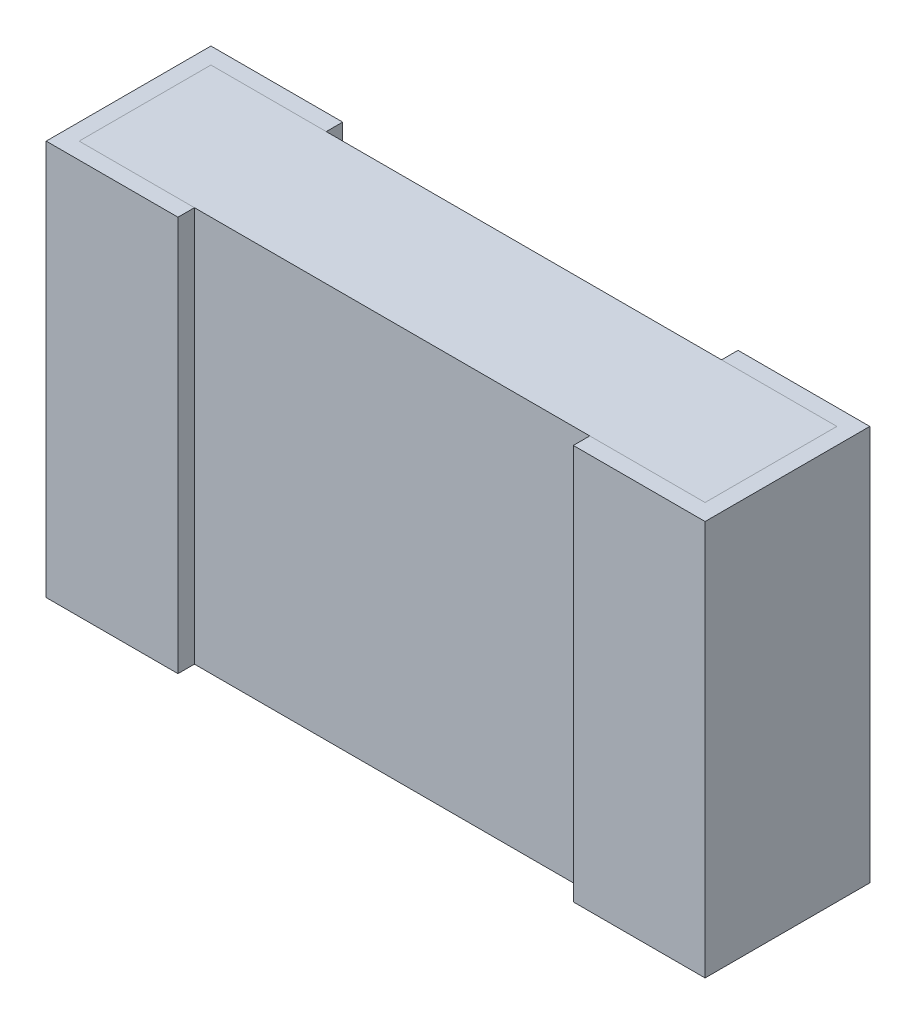
ISO-10303-21;
HEADER;
FILE_DESCRIPTION(('STEP AP214'),'2;1');
FILE_NAME('part.step','',(''),(''),'','','');
FILE_SCHEMA(('AUTOMOTIVE_DESIGN { 1 0 10303 214 1 1 1 1 }'));
ENDSEC;
DATA;
#1=APPLICATION_CONTEXT('core data for automotive mechanical design processes');
#2=APPLICATION_PROTOCOL_DEFINITION('international standard','automotive_design',2000,#1);
#3=PRODUCT_CONTEXT('',#1,'mechanical');
#4=PRODUCT('Part','Part','',(#3));
#5=PRODUCT_RELATED_PRODUCT_CATEGORY('part','',(#4));
#6=PRODUCT_DEFINITION_FORMATION('','',#4);
#7=PRODUCT_DEFINITION_CONTEXT('part definition',#1,'design');
#8=PRODUCT_DEFINITION('design','',#6,#7);
#9=PRODUCT_DEFINITION_SHAPE('','',#8);
#10=(LENGTH_UNIT() NAMED_UNIT(*) SI_UNIT(.MILLI.,.METRE.));
#11=(NAMED_UNIT(*) PLANE_ANGLE_UNIT() SI_UNIT($,.RADIAN.));
#12=(NAMED_UNIT(*) SI_UNIT($,.STERADIAN.) SOLID_ANGLE_UNIT());
#13=UNCERTAINTY_MEASURE_WITH_UNIT(LENGTH_MEASURE(1.E-05),#10,'distance_accuracy_value','');
#14=(GEOMETRIC_REPRESENTATION_CONTEXT(3) GLOBAL_UNCERTAINTY_ASSIGNED_CONTEXT((#13)) GLOBAL_UNIT_ASSIGNED_CONTEXT((#10,
#11,#12)) REPRESENTATION_CONTEXT('',''));
#15=CARTESIAN_POINT('',(0.,0.,0.));
#16=DIRECTION('',(0.,0.,1.));
#17=DIRECTION('',(1.,0.,0.));
#18=AXIS2_PLACEMENT_3D('',#15,#16,#17);
#19=CARTESIAN_POINT('',(0.561829086584,1.2,0.09556197731724));
#20=DIRECTION('',(0.,0.,1.));
#21=DIRECTION('',(1.,0.,0.));
#22=AXIS2_PLACEMENT_3D('',#19,#20,#21);
#23=PLANE('',#22);
#24=DIRECTION('',(1.,0.,0.));
#25=VECTOR('',#24,1.);
#26=CARTESIAN_POINT('',(0.,1.2,0.09556197731724));
#27=LINE('',#26,#25);
#28=CARTESIAN_POINT('',(0.561829086584,1.2,0.09556197731724));
#29=VERTEX_POINT('',#28);
#30=CARTESIAN_POINT('',(0.211829086584,1.2,0.09556197731724));
#31=VERTEX_POINT('',#30);
#32=EDGE_CURVE('P0_E115',#29,#31,#27,.F.);
#33=ORIENTED_EDGE('',*,*,#32,.F.);
#34=DIRECTION('',(0.,1.,0.));
#35=VECTOR('',#34,1.);
#36=CARTESIAN_POINT('',(0.561829086584,1.2,0.09556197731724));
#37=LINE('',#36,#35);
#38=CARTESIAN_POINT('',(0.561829086584,0.,0.09556197731724));
#39=VERTEX_POINT('',#38);
#40=EDGE_CURVE('P0_E92',#29,#39,#37,.F.);
#41=ORIENTED_EDGE('',*,*,#40,.T.);
#42=DIRECTION('',(1.,0.,0.));
#43=VECTOR('',#42,1.);
#44=CARTESIAN_POINT('',(0.,0.,0.09556197731724));
#45=LINE('',#44,#43);
#46=CARTESIAN_POINT('',(0.211829086584,0.,0.09556197731724));
#47=VERTEX_POINT('',#46);
#48=EDGE_CURVE('P0_E116',#39,#47,#45,.F.);
#49=ORIENTED_EDGE('',*,*,#48,.T.);
#50=DIRECTION('',(0.,1.,0.));
#51=VECTOR('',#50,1.);
#52=CARTESIAN_POINT('',(0.211829086584,1.2,0.09556197731724));
#53=LINE('',#52,#51);
#54=EDGE_CURVE('P0_E19',#47,#31,#53,.T.);
#55=ORIENTED_EDGE('',*,*,#54,.T.);
#56=EDGE_LOOP('',(#33,#41,#49,#55));
#57=FACE_BOUND('',#56,.T.);
#58=ADVANCED_FACE('P0_F16',(#57),#23,.F.);
#59=CARTESIAN_POINT('',(0.211829086584,1.2,0.09556197731724));
#60=DIRECTION('',(-1.,0.,0.));
#61=DIRECTION('',(0.,0.,1.));
#62=AXIS2_PLACEMENT_3D('',#59,#60,#61);
#63=PLANE('',#62);
#64=DIRECTION('',(0.,0.,1.));
#65=VECTOR('',#64,1.);
#66=CARTESIAN_POINT('',(0.211829086584,1.2,0.));
#67=LINE('',#66,#65);
#68=CARTESIAN_POINT('',(0.211829086584,1.2,-0.304438022683));
#69=VERTEX_POINT('',#68);
#70=EDGE_CURVE('P0_E117',#31,#69,#67,.F.);
#71=ORIENTED_EDGE('',*,*,#70,.F.);
#72=ORIENTED_EDGE('',*,*,#54,.F.);
#73=DIRECTION('',(0.,0.,1.));
#74=VECTOR('',#73,1.);
#75=CARTESIAN_POINT('',(0.211829086584,0.,0.));
#76=LINE('',#75,#74);
#77=CARTESIAN_POINT('',(0.211829086584,0.,-0.304438022683));
#78=VERTEX_POINT('',#77);
#79=EDGE_CURVE('P0_E129',#47,#78,#76,.F.);
#80=ORIENTED_EDGE('',*,*,#79,.T.);
#81=DIRECTION('',(0.,1.,0.));
#82=VECTOR('',#81,1.);
#83=CARTESIAN_POINT('',(0.211829086584,1.2,-0.304438022683));
#84=LINE('',#83,#82);
#85=EDGE_CURVE('P0_E79',#78,#69,#84,.T.);
#86=ORIENTED_EDGE('',*,*,#85,.T.);
#87=EDGE_LOOP('',(#71,#72,#80,#86));
#88=FACE_BOUND('',#87,.T.);
#89=ADVANCED_FACE('P0_F118',(#88),#63,.F.);
#90=CARTESIAN_POINT('',(0.211829086584,1.2,-0.304438022683));
#91=DIRECTION('',(0.,0.,-1.));
#92=DIRECTION('',(-1.,0.,0.));
#93=AXIS2_PLACEMENT_3D('',#90,#91,#92);
#94=PLANE('',#93);
#95=DIRECTION('',(1.,0.,0.));
#96=VECTOR('',#95,1.);
#97=CARTESIAN_POINT('',(0.,1.2,-0.304438022683));
#98=LINE('',#97,#96);
#99=CARTESIAN_POINT('',(0.561829086584,1.2,-0.304438022683));
#100=VERTEX_POINT('',#99);
#101=EDGE_CURVE('P0_E120',#69,#100,#98,.T.);
#102=ORIENTED_EDGE('',*,*,#101,.F.);
#103=ORIENTED_EDGE('',*,*,#85,.F.);
#104=DIRECTION('',(1.,0.,0.));
#105=VECTOR('',#104,1.);
#106=CARTESIAN_POINT('',(0.,0.,-0.304438022683));
#107=LINE('',#106,#105);
#108=CARTESIAN_POINT('',(0.561829086584,0.,-0.304438022683));
#109=VERTEX_POINT('',#108);
#110=EDGE_CURVE('P0_E99',#78,#109,#107,.T.);
#111=ORIENTED_EDGE('',*,*,#110,.T.);
#112=DIRECTION('',(0.,1.,0.));
#113=VECTOR('',#112,1.);
#114=CARTESIAN_POINT('',(0.561829086584,1.2,-0.304438022683));
#115=LINE('',#114,#113);
#116=EDGE_CURVE('P0_E85',#109,#100,#115,.T.);
#117=ORIENTED_EDGE('',*,*,#116,.T.);
#118=EDGE_LOOP('',(#102,#103,#111,#117));
#119=FACE_BOUND('',#118,.T.);
#120=ADVANCED_FACE('P0_F105',(#119),#94,.F.);
#121=CARTESIAN_POINT('',(0.561829086584,1.2,-0.304438022683));
#122=DIRECTION('',(-1.,0.,0.));
#123=DIRECTION('',(0.,0.,1.));
#124=AXIS2_PLACEMENT_3D('',#121,#122,#123);
#125=PLANE('',#124);
#126=DIRECTION('',(0.,0.,1.));
#127=VECTOR('',#126,1.);
#128=CARTESIAN_POINT('',(0.561829086584,1.2,0.));
#129=LINE('',#128,#127);
#130=CARTESIAN_POINT('',(0.561829086584,1.2,-0.354438022683));
#131=VERTEX_POINT('',#130);
#132=EDGE_CURVE('P0_E91',#100,#131,#129,.F.);
#133=ORIENTED_EDGE('',*,*,#132,.F.);
#134=ORIENTED_EDGE('',*,*,#116,.F.);
#135=DIRECTION('',(0.,0.,1.));
#136=VECTOR('',#135,1.);
#137=CARTESIAN_POINT('',(0.561829086584,0.,0.));
#138=LINE('',#137,#136);
#139=CARTESIAN_POINT('',(0.561829086584,0.,-0.354438022683));
#140=VERTEX_POINT('',#139);
#141=EDGE_CURVE('P0_E89',#109,#140,#138,.F.);
#142=ORIENTED_EDGE('',*,*,#141,.T.);
#143=DIRECTION('',(0.,1.,0.));
#144=VECTOR('',#143,1.);
#145=CARTESIAN_POINT('',(0.561829086584,1.2,-0.354438022683));
#146=LINE('',#145,#144);
#147=EDGE_CURVE('P0_E123',#140,#131,#146,.T.);
#148=ORIENTED_EDGE('',*,*,#147,.T.);
#149=EDGE_LOOP('',(#133,#134,#142,#148));
#150=FACE_BOUND('',#149,.T.);
#151=ADVANCED_FACE('P0_F87',(#150),#125,.F.);
#152=CARTESIAN_POINT('',(0.561829086584,1.2,0.145561977317));
#153=DIRECTION('',(-1.,0.,0.));
#154=DIRECTION('',(0.,0.,1.));
#155=AXIS2_PLACEMENT_3D('',#152,#153,#154);
#156=PLANE('',#155);
#157=DIRECTION('',(0.,0.,1.));
#158=VECTOR('',#157,1.);
#159=CARTESIAN_POINT('',(0.561829086584,1.2,0.));
#160=LINE('',#159,#158);
#161=CARTESIAN_POINT('',(0.561829086584,1.2,0.145561977317));
#162=VERTEX_POINT('',#161);
#163=EDGE_CURVE('P0_E141',#162,#29,#160,.F.);
#164=ORIENTED_EDGE('',*,*,#163,.F.);
#165=DIRECTION('',(0.,1.,0.));
#166=VECTOR('',#165,1.);
#167=CARTESIAN_POINT('',(0.561829086584,1.2,0.145561977317));
#168=LINE('',#167,#166);
#169=CARTESIAN_POINT('',(0.561829086584,0.,0.145561977317));
#170=VERTEX_POINT('',#169);
#171=EDGE_CURVE('P0_E136',#162,#170,#168,.F.);
#172=ORIENTED_EDGE('',*,*,#171,.T.);
#173=DIRECTION('',(0.,0.,1.));
#174=VECTOR('',#173,1.);
#175=CARTESIAN_POINT('',(0.561829086584,0.,0.));
#176=LINE('',#175,#174);
#177=EDGE_CURVE('P0_E103',#170,#39,#176,.F.);
#178=ORIENTED_EDGE('',*,*,#177,.T.);
#179=ORIENTED_EDGE('',*,*,#40,.F.);
#180=EDGE_LOOP('',(#164,#172,#178,#179));
#181=FACE_BOUND('',#180,.T.);
#182=ADVANCED_FACE('P0_F134',(#181),#156,.F.);
#183=CARTESIAN_POINT('',(0.,0.,0.));
#184=DIRECTION('',(0.,1.,0.));
#185=DIRECTION('',(0.,0.,1.));
#186=AXIS2_PLACEMENT_3D('',#183,#184,#185);
#187=PLANE('',#186);
#188=ORIENTED_EDGE('',*,*,#48,.F.);
#189=ORIENTED_EDGE('',*,*,#177,.F.);
#190=DIRECTION('',(-1.,0.,0.));
#191=VECTOR('',#190,1.);
#192=CARTESIAN_POINT('',(0.161829086584,0.,0.145561977317));
#193=LINE('',#192,#191);
#194=CARTESIAN_POINT('',(0.161829086584,0.,0.145561977317));
#195=VERTEX_POINT('',#194);
#196=EDGE_CURVE('P0_E139',#170,#195,#193,.T.);
#197=ORIENTED_EDGE('',*,*,#196,.T.);
#198=DIRECTION('',(0.,0.,-1.));
#199=VECTOR('',#198,1.);
#200=CARTESIAN_POINT('',(0.161829086584,0.,-0.354438022683));
#201=LINE('',#200,#199);
#202=CARTESIAN_POINT('',(0.161829086584,0.,-0.354438022683));
#203=VERTEX_POINT('',#202);
#204=EDGE_CURVE('P0_E158',#195,#203,#201,.T.);
#205=ORIENTED_EDGE('',*,*,#204,.T.);
#206=DIRECTION('',(1.,0.,0.));
#207=VECTOR('',#206,1.);
#208=CARTESIAN_POINT('',(0.561829086584,0.,-0.354438022683));
#209=LINE('',#208,#207);
#210=EDGE_CURVE('P0_E102',#203,#140,#209,.T.);
#211=ORIENTED_EDGE('',*,*,#210,.T.);
#212=ORIENTED_EDGE('',*,*,#141,.F.);
#213=ORIENTED_EDGE('',*,*,#110,.F.);
#214=ORIENTED_EDGE('',*,*,#79,.F.);
#215=EDGE_LOOP('',(#188,#189,#197,#205,#211,#212,#213,#214));
#216=FACE_BOUND('',#215,.T.);
#217=ADVANCED_FACE('P0_F97',(#216),#187,.F.);
#218=CARTESIAN_POINT('',(0.561829086584,1.2,-0.354438022683));
#219=DIRECTION('',(0.,0.,1.));
#220=DIRECTION('',(1.,0.,0.));
#221=AXIS2_PLACEMENT_3D('',#218,#219,#220);
#222=PLANE('',#221);
#223=DIRECTION('',(1.,0.,0.));
#224=VECTOR('',#223,1.);
#225=CARTESIAN_POINT('',(0.,1.2,-0.354438022683));
#226=LINE('',#225,#224);
#227=CARTESIAN_POINT('',(0.161829086584,1.2,-0.354438022683));
#228=VERTEX_POINT('',#227);
#229=EDGE_CURVE('P0_E144',#131,#228,#226,.F.);
#230=ORIENTED_EDGE('',*,*,#229,.F.);
#231=ORIENTED_EDGE('',*,*,#147,.F.);
#232=ORIENTED_EDGE('',*,*,#210,.F.);
#233=DIRECTION('',(0.,1.,0.));
#234=VECTOR('',#233,1.);
#235=CARTESIAN_POINT('',(0.161829086584,1.2,-0.354438022683));
#236=LINE('',#235,#234);
#237=EDGE_CURVE('P0_E156',#203,#228,#236,.T.);
#238=ORIENTED_EDGE('',*,*,#237,.T.);
#239=EDGE_LOOP('',(#230,#231,#232,#238));
#240=FACE_BOUND('',#239,.T.);
#241=ADVANCED_FACE('P0_F154',(#240),#222,.F.);
#242=CARTESIAN_POINT('',(0.,1.2,0.));
#243=DIRECTION('',(0.,1.,0.));
#244=DIRECTION('',(0.,0.,1.));
#245=AXIS2_PLACEMENT_3D('',#242,#243,#244);
#246=PLANE('',#245);
#247=DIRECTION('',(-1.,0.,0.));
#248=VECTOR('',#247,1.);
#249=CARTESIAN_POINT('',(0.161829086584,1.2,0.145561977317));
#250=LINE('',#249,#248);
#251=CARTESIAN_POINT('',(0.161829086584,1.2,0.145561977317));
#252=VERTEX_POINT('',#251);
#253=EDGE_CURVE('P0_E33',#252,#162,#250,.F.);
#254=ORIENTED_EDGE('',*,*,#253,.T.);
#255=ORIENTED_EDGE('',*,*,#163,.T.);
#256=ORIENTED_EDGE('',*,*,#32,.T.);
#257=ORIENTED_EDGE('',*,*,#70,.T.);
#258=ORIENTED_EDGE('',*,*,#101,.T.);
#259=ORIENTED_EDGE('',*,*,#132,.T.);
#260=ORIENTED_EDGE('',*,*,#229,.T.);
#261=DIRECTION('',(0.,0.,-1.));
#262=VECTOR('',#261,1.);
#263=CARTESIAN_POINT('',(0.161829086584,1.2,-0.354438022683));
#264=LINE('',#263,#262);
#265=EDGE_CURVE('P0_E25',#228,#252,#264,.F.);
#266=ORIENTED_EDGE('',*,*,#265,.T.);
#267=EDGE_LOOP('',(#254,#255,#256,#257,#258,#259,#260,#266));
#268=FACE_BOUND('',#267,.T.);
#269=ADVANCED_FACE('P0_F148',(#268),#246,.T.);
#270=CARTESIAN_POINT('',(0.161829086584,1.2,0.145561977317));
#271=DIRECTION('',(0.,0.,-1.));
#272=DIRECTION('',(-1.,0.,0.));
#273=AXIS2_PLACEMENT_3D('',#270,#271,#272);
#274=PLANE('',#273);
#275=ORIENTED_EDGE('',*,*,#253,.F.);
#276=DIRECTION('',(0.,1.,0.));
#277=VECTOR('',#276,1.);
#278=CARTESIAN_POINT('',(0.161829086584,1.2,0.145561977317));
#279=LINE('',#278,#277);
#280=EDGE_CURVE('P0_E11',#252,#195,#279,.F.);
#281=ORIENTED_EDGE('',*,*,#280,.T.);
#282=ORIENTED_EDGE('',*,*,#196,.F.);
#283=ORIENTED_EDGE('',*,*,#171,.F.);
#284=EDGE_LOOP('',(#275,#281,#282,#283));
#285=FACE_BOUND('',#284,.T.);
#286=ADVANCED_FACE('P0_F140',(#285),#274,.F.);
#287=CARTESIAN_POINT('',(0.161829086584,1.2,-0.354438022683));
#288=DIRECTION('',(1.,0.,0.));
#289=DIRECTION('',(0.,0.,-1.));
#290=AXIS2_PLACEMENT_3D('',#287,#288,#289);
#291=PLANE('',#290);
#292=ORIENTED_EDGE('',*,*,#265,.F.);
#293=ORIENTED_EDGE('',*,*,#237,.F.);
#294=ORIENTED_EDGE('',*,*,#204,.F.);
#295=ORIENTED_EDGE('',*,*,#280,.F.);
#296=EDGE_LOOP('',(#292,#293,#294,#295));
#297=FACE_BOUND('',#296,.T.);
#298=ADVANCED_FACE('P0_F162',(#297),#291,.F.);
#299=CLOSED_SHELL('',(#58,#89,#120,#151,#182,#217,#241,#269,#286,#298));
#300=MANIFOLD_SOLID_BREP('P0_B1',#299);
#301=CARTESIAN_POINT('',(2.111829086584,1.2,-0.304438022683));
#302=DIRECTION('',(0.,0.,-1.));
#303=DIRECTION('',(-1.,0.,0.));
#304=AXIS2_PLACEMENT_3D('',#301,#302,#303);
#305=PLANE('',#304);
#306=DIRECTION('',(1.,0.,0.));
#307=VECTOR('',#306,1.);
#308=CARTESIAN_POINT('',(0.,1.2,-0.304438022683));
#309=LINE('',#308,#307);
#310=CARTESIAN_POINT('',(1.761829086584,1.2,-0.304438022683));
#311=VERTEX_POINT('',#310);
#312=CARTESIAN_POINT('',(2.111829086584,1.2,-0.304438022683));
#313=VERTEX_POINT('',#312);
#314=EDGE_CURVE('P1_E125',#311,#313,#309,.T.);
#315=ORIENTED_EDGE('',*,*,#314,.F.);
#316=DIRECTION('',(0.,1.,0.));
#317=VECTOR('',#316,1.);
#318=CARTESIAN_POINT('',(1.761829086584,1.2,-0.304438022683));
#319=LINE('',#318,#317);
#320=CARTESIAN_POINT('',(1.761829086584,0.,-0.304438022683));
#321=VERTEX_POINT('',#320);
#322=EDGE_CURVE('P1_E102',#311,#321,#319,.F.);
#323=ORIENTED_EDGE('',*,*,#322,.T.);
#324=DIRECTION('',(1.,0.,0.));
#325=VECTOR('',#324,1.);
#326=CARTESIAN_POINT('',(0.,0.,-0.304438022683));
#327=LINE('',#326,#325);
#328=CARTESIAN_POINT('',(2.111829086584,0.,-0.304438022683));
#329=VERTEX_POINT('',#328);
#330=EDGE_CURVE('P1_E133',#321,#329,#327,.T.);
#331=ORIENTED_EDGE('',*,*,#330,.T.);
#332=DIRECTION('',(0.,1.,0.));
#333=VECTOR('',#332,1.);
#334=CARTESIAN_POINT('',(2.111829086584,1.2,-0.304438022683));
#335=LINE('',#334,#333);
#336=EDGE_CURVE('P1_E19',#329,#313,#335,.T.);
#337=ORIENTED_EDGE('',*,*,#336,.T.);
#338=EDGE_LOOP('',(#315,#323,#331,#337));
#339=FACE_BOUND('',#338,.T.);
#340=ADVANCED_FACE('P1_F16',(#339),#305,.F.);
#341=CARTESIAN_POINT('',(2.111829086584,1.2,0.09556197731724));
#342=DIRECTION('',(1.,0.,0.));
#343=DIRECTION('',(0.,0.,-1.));
#344=AXIS2_PLACEMENT_3D('',#341,#342,#343);
#345=PLANE('',#344);
#346=DIRECTION('',(0.,0.,1.));
#347=VECTOR('',#346,1.);
#348=CARTESIAN_POINT('',(2.111829086584,1.2,0.));
#349=LINE('',#348,#347);
#350=CARTESIAN_POINT('',(2.111829086584,1.2,0.09556197731724));
#351=VERTEX_POINT('',#350);
#352=EDGE_CURVE('P1_E120',#313,#351,#349,.T.);
#353=ORIENTED_EDGE('',*,*,#352,.F.);
#354=ORIENTED_EDGE('',*,*,#336,.F.);
#355=DIRECTION('',(0.,0.,1.));
#356=VECTOR('',#355,1.);
#357=CARTESIAN_POINT('',(2.111829086584,0.,0.));
#358=LINE('',#357,#356);
#359=CARTESIAN_POINT('',(2.111829086584,0.,0.09556197731724));
#360=VERTEX_POINT('',#359);
#361=EDGE_CURVE('P1_E96',#329,#360,#358,.T.);
#362=ORIENTED_EDGE('',*,*,#361,.T.);
#363=DIRECTION('',(0.,1.,0.));
#364=VECTOR('',#363,1.);
#365=CARTESIAN_POINT('',(2.111829086584,1.2,0.09556197731724));
#366=LINE('',#365,#364);
#367=EDGE_CURVE('P1_E85',#360,#351,#366,.T.);
#368=ORIENTED_EDGE('',*,*,#367,.T.);
#369=EDGE_LOOP('',(#353,#354,#362,#368));
#370=FACE_BOUND('',#369,.T.);
#371=ADVANCED_FACE('P1_F101',(#370),#345,.F.);
#372=CARTESIAN_POINT('',(1.761829086584,1.2,0.09556197731724));
#373=DIRECTION('',(0.,0.,1.));
#374=DIRECTION('',(1.,0.,0.));
#375=AXIS2_PLACEMENT_3D('',#372,#373,#374);
#376=PLANE('',#375);
#377=DIRECTION('',(1.,0.,0.));
#378=VECTOR('',#377,1.);
#379=CARTESIAN_POINT('',(0.,1.2,0.09556197731724));
#380=LINE('',#379,#378);
#381=CARTESIAN_POINT('',(1.761829086584,1.2,0.09556197731724));
#382=VERTEX_POINT('',#381);
#383=EDGE_CURVE('P1_E90',#351,#382,#380,.F.);
#384=ORIENTED_EDGE('',*,*,#383,.F.);
#385=ORIENTED_EDGE('',*,*,#367,.F.);
#386=DIRECTION('',(1.,0.,0.));
#387=VECTOR('',#386,1.);
#388=CARTESIAN_POINT('',(0.,0.,0.09556197731724));
#389=LINE('',#388,#387);
#390=CARTESIAN_POINT('',(1.761829086584,0.,0.09556197731724));
#391=VERTEX_POINT('',#390);
#392=EDGE_CURVE('P1_E89',#360,#391,#389,.F.);
#393=ORIENTED_EDGE('',*,*,#392,.T.);
#394=DIRECTION('',(0.,1.,0.));
#395=VECTOR('',#394,1.);
#396=CARTESIAN_POINT('',(1.761829086584,1.2,0.09556197731724));
#397=LINE('',#396,#395);
#398=EDGE_CURVE('P1_E91',#391,#382,#397,.T.);
#399=ORIENTED_EDGE('',*,*,#398,.T.);
#400=EDGE_LOOP('',(#384,#385,#393,#399));
#401=FACE_BOUND('',#400,.T.);
#402=ADVANCED_FACE('P1_F87',(#401),#376,.F.);
#403=CARTESIAN_POINT('',(1.761829086584,1.2,0.145561977317));
#404=DIRECTION('',(1.,0.,0.));
#405=DIRECTION('',(0.,0.,-1.));
#406=AXIS2_PLACEMENT_3D('',#403,#404,#405);
#407=PLANE('',#406);
#408=DIRECTION('',(0.,0.,1.));
#409=VECTOR('',#408,1.);
#410=CARTESIAN_POINT('',(1.761829086584,1.2,0.));
#411=LINE('',#410,#409);
#412=CARTESIAN_POINT('',(1.761829086584,1.2,0.145561977317));
#413=VERTEX_POINT('',#412);
#414=EDGE_CURVE('P1_E110',#382,#413,#411,.T.);
#415=ORIENTED_EDGE('',*,*,#414,.F.);
#416=ORIENTED_EDGE('',*,*,#398,.F.);
#417=DIRECTION('',(0.,0.,1.));
#418=VECTOR('',#417,1.);
#419=CARTESIAN_POINT('',(1.761829086584,0.,0.));
#420=LINE('',#419,#418);
#421=CARTESIAN_POINT('',(1.761829086584,0.,0.145561977317));
#422=VERTEX_POINT('',#421);
#423=EDGE_CURVE('P1_E99',#391,#422,#420,.T.);
#424=ORIENTED_EDGE('',*,*,#423,.T.);
#425=DIRECTION('',(0.,1.,0.));
#426=VECTOR('',#425,1.);
#427=CARTESIAN_POINT('',(1.761829086584,1.2,0.145561977317));
#428=LINE('',#427,#426);
#429=EDGE_CURVE('P1_E113',#422,#413,#428,.T.);
#430=ORIENTED_EDGE('',*,*,#429,.T.);
#431=EDGE_LOOP('',(#415,#416,#424,#430));
#432=FACE_BOUND('',#431,.T.);
#433=ADVANCED_FACE('P1_F111',(#432),#407,.F.);
#434=CARTESIAN_POINT('',(1.761829086584,1.2,-0.304438022683));
#435=DIRECTION('',(1.,0.,0.));
#436=DIRECTION('',(0.,0.,-1.));
#437=AXIS2_PLACEMENT_3D('',#434,#435,#436);
#438=PLANE('',#437);
#439=DIRECTION('',(0.,0.,1.));
#440=VECTOR('',#439,1.);
#441=CARTESIAN_POINT('',(1.761829086584,1.2,0.));
#442=LINE('',#441,#440);
#443=CARTESIAN_POINT('',(1.761829086584,1.2,-0.354438022683));
#444=VERTEX_POINT('',#443);
#445=EDGE_CURVE('P1_E127',#444,#311,#442,.T.);
#446=ORIENTED_EDGE('',*,*,#445,.F.);
#447=DIRECTION('',(0.,1.,0.));
#448=VECTOR('',#447,1.);
#449=CARTESIAN_POINT('',(1.761829086584,1.2,-0.354438022683));
#450=LINE('',#449,#448);
#451=CARTESIAN_POINT('',(1.761829086584,0.,-0.354438022683));
#452=VERTEX_POINT('',#451);
#453=EDGE_CURVE('P1_E147',#444,#452,#450,.F.);
#454=ORIENTED_EDGE('',*,*,#453,.T.);
#455=DIRECTION('',(0.,0.,1.));
#456=VECTOR('',#455,1.);
#457=CARTESIAN_POINT('',(1.761829086584,0.,0.));
#458=LINE('',#457,#456);
#459=EDGE_CURVE('P1_E135',#452,#321,#458,.T.);
#460=ORIENTED_EDGE('',*,*,#459,.T.);
#461=ORIENTED_EDGE('',*,*,#322,.F.);
#462=EDGE_LOOP('',(#446,#454,#460,#461));
#463=FACE_BOUND('',#462,.T.);
#464=ADVANCED_FACE('P1_F161',(#463),#438,.F.);
#465=CARTESIAN_POINT('',(0.,0.,0.));
#466=DIRECTION('',(0.,1.,0.));
#467=DIRECTION('',(0.,0.,1.));
#468=AXIS2_PLACEMENT_3D('',#465,#466,#467);
#469=PLANE('',#468);
#470=ORIENTED_EDGE('',*,*,#459,.F.);
#471=DIRECTION('',(1.,0.,0.));
#472=VECTOR('',#471,1.);
#473=CARTESIAN_POINT('',(1.761829086584,0.,-0.354438022683));
#474=LINE('',#473,#472);
#475=CARTESIAN_POINT('',(2.161829086584,0.,-0.354438022683));
#476=VERTEX_POINT('',#475);
#477=EDGE_CURVE('P1_E118',#452,#476,#474,.T.);
#478=ORIENTED_EDGE('',*,*,#477,.T.);
#479=DIRECTION('',(0.,0.,1.));
#480=VECTOR('',#479,1.);
#481=CARTESIAN_POINT('',(2.161829086584,0.,-0.354438022683));
#482=LINE('',#481,#480);
#483=CARTESIAN_POINT('',(2.161829086584,0.,0.145561977317));
#484=VERTEX_POINT('',#483);
#485=EDGE_CURVE('P1_E143',#476,#484,#482,.T.);
#486=ORIENTED_EDGE('',*,*,#485,.T.);
#487=DIRECTION('',(-1.,0.,0.));
#488=VECTOR('',#487,1.);
#489=CARTESIAN_POINT('',(2.161829086584,0.,0.145561977317));
#490=LINE('',#489,#488);
#491=EDGE_CURVE('P1_E131',#484,#422,#490,.T.);
#492=ORIENTED_EDGE('',*,*,#491,.T.);
#493=ORIENTED_EDGE('',*,*,#423,.F.);
#494=ORIENTED_EDGE('',*,*,#392,.F.);
#495=ORIENTED_EDGE('',*,*,#361,.F.);
#496=ORIENTED_EDGE('',*,*,#330,.F.);
#497=EDGE_LOOP('',(#470,#478,#486,#492,#493,#494,#495,#496));
#498=FACE_BOUND('',#497,.T.);
#499=ADVANCED_FACE('P1_F94',(#498),#469,.F.);
#500=CARTESIAN_POINT('',(2.161829086584,1.2,0.145561977317));
#501=DIRECTION('',(0.,0.,-1.));
#502=DIRECTION('',(-1.,0.,0.));
#503=AXIS2_PLACEMENT_3D('',#500,#501,#502);
#504=PLANE('',#503);
#505=DIRECTION('',(1.,0.,0.));
#506=VECTOR('',#505,1.);
#507=CARTESIAN_POINT('',(0.,1.2,0.145561977317));
#508=LINE('',#507,#506);
#509=CARTESIAN_POINT('',(2.161829086584,1.2,0.145561977317));
#510=VERTEX_POINT('',#509);
#511=EDGE_CURVE('P1_E116',#413,#510,#508,.T.);
#512=ORIENTED_EDGE('',*,*,#511,.F.);
#513=ORIENTED_EDGE('',*,*,#429,.F.);
#514=ORIENTED_EDGE('',*,*,#491,.F.);
#515=DIRECTION('',(0.,1.,0.));
#516=VECTOR('',#515,1.);
#517=CARTESIAN_POINT('',(2.161829086584,1.2,0.145561977317));
#518=LINE('',#517,#516);
#519=EDGE_CURVE('P1_E146',#484,#510,#518,.T.);
#520=ORIENTED_EDGE('',*,*,#519,.T.);
#521=EDGE_LOOP('',(#512,#513,#514,#520));
#522=FACE_BOUND('',#521,.T.);
#523=ADVANCED_FACE('P1_F138',(#522),#504,.F.);
#524=CARTESIAN_POINT('',(0.,1.2,0.));
#525=DIRECTION('',(0.,1.,0.));
#526=DIRECTION('',(0.,0.,1.));
#527=AXIS2_PLACEMENT_3D('',#524,#525,#526);
#528=PLANE('',#527);
#529=DIRECTION('',(0.,0.,1.));
#530=VECTOR('',#529,1.);
#531=CARTESIAN_POINT('',(2.161829086584,1.2,-0.354438022683));
#532=LINE('',#531,#530);
#533=CARTESIAN_POINT('',(2.161829086584,1.2,-0.354438022683));
#534=VERTEX_POINT('',#533);
#535=EDGE_CURVE('P1_E25',#510,#534,#532,.F.);
#536=ORIENTED_EDGE('',*,*,#535,.T.);
#537=DIRECTION('',(1.,0.,0.));
#538=VECTOR('',#537,1.);
#539=CARTESIAN_POINT('',(1.761829086584,1.2,-0.354438022683));
#540=LINE('',#539,#538);
#541=EDGE_CURVE('P1_E33',#534,#444,#540,.F.);
#542=ORIENTED_EDGE('',*,*,#541,.T.);
#543=ORIENTED_EDGE('',*,*,#445,.T.);
#544=ORIENTED_EDGE('',*,*,#314,.T.);
#545=ORIENTED_EDGE('',*,*,#352,.T.);
#546=ORIENTED_EDGE('',*,*,#383,.T.);
#547=ORIENTED_EDGE('',*,*,#414,.T.);
#548=ORIENTED_EDGE('',*,*,#511,.T.);
#549=EDGE_LOOP('',(#536,#542,#543,#544,#545,#546,#547,#548));
#550=FACE_BOUND('',#549,.T.);
#551=ADVANCED_FACE('P1_F155',(#550),#528,.T.);
#552=CARTESIAN_POINT('',(1.761829086584,1.2,-0.354438022683));
#553=DIRECTION('',(0.,0.,1.));
#554=DIRECTION('',(1.,0.,0.));
#555=AXIS2_PLACEMENT_3D('',#552,#553,#554);
#556=PLANE('',#555);
#557=ORIENTED_EDGE('',*,*,#541,.F.);
#558=DIRECTION('',(0.,1.,0.));
#559=VECTOR('',#558,1.);
#560=CARTESIAN_POINT('',(2.161829086584,1.2,-0.354438022683));
#561=LINE('',#560,#559);
#562=EDGE_CURVE('P1_E11',#534,#476,#561,.F.);
#563=ORIENTED_EDGE('',*,*,#562,.T.);
#564=ORIENTED_EDGE('',*,*,#477,.F.);
#565=ORIENTED_EDGE('',*,*,#453,.F.);
#566=EDGE_LOOP('',(#557,#563,#564,#565));
#567=FACE_BOUND('',#566,.T.);
#568=ADVANCED_FACE('P1_F159',(#567),#556,.F.);
#569=CARTESIAN_POINT('',(2.161829086584,1.2,-0.354438022683));
#570=DIRECTION('',(-1.,0.,0.));
#571=DIRECTION('',(0.,0.,1.));
#572=AXIS2_PLACEMENT_3D('',#569,#570,#571);
#573=PLANE('',#572);
#574=ORIENTED_EDGE('',*,*,#535,.F.);
#575=ORIENTED_EDGE('',*,*,#519,.F.);
#576=ORIENTED_EDGE('',*,*,#485,.F.);
#577=ORIENTED_EDGE('',*,*,#562,.F.);
#578=EDGE_LOOP('',(#574,#575,#576,#577));
#579=FACE_BOUND('',#578,.T.);
#580=ADVANCED_FACE('P1_F158',(#579),#573,.F.);
#581=CLOSED_SHELL('',(#340,#371,#402,#433,#464,#499,#523,#551,#568,#580));
#582=MANIFOLD_SOLID_BREP('P1_B1',#581);
#583=CARTESIAN_POINT('',(0.211829086584,1.2,-0.304438022683));
#584=DIRECTION('',(0.,0.,-1.));
#585=DIRECTION('',(-1.,0.,0.));
#586=AXIS2_PLACEMENT_3D('',#583,#584,#585);
#587=PLANE('',#586);
#588=DIRECTION('',(1.,0.,0.));
#589=VECTOR('',#588,1.);
#590=CARTESIAN_POINT('',(0.,0.,-0.304438022683));
#591=LINE('',#590,#589);
#592=CARTESIAN_POINT('',(0.211829086584,0.,-0.304438022683));
#593=VERTEX_POINT('',#592);
#594=CARTESIAN_POINT('',(2.111829086584,0.,-0.304438022683));
#595=VERTEX_POINT('',#594);
#596=EDGE_CURVE('P2_E68',#593,#595,#591,.T.);
#597=ORIENTED_EDGE('',*,*,#596,.F.);
#598=DIRECTION('',(0.,1.,0.));
#599=VECTOR('',#598,1.);
#600=CARTESIAN_POINT('',(0.211829086584,1.2,-0.304438022683));
#601=LINE('',#600,#599);
#602=CARTESIAN_POINT('',(0.211829086584,1.2,-0.304438022683));
#603=VERTEX_POINT('',#602);
#604=EDGE_CURVE('P2_E55',#603,#593,#601,.F.);
#605=ORIENTED_EDGE('',*,*,#604,.F.);
#606=DIRECTION('',(1.,0.,0.));
#607=VECTOR('',#606,1.);
#608=CARTESIAN_POINT('',(0.,1.2,-0.304438022683));
#609=LINE('',#608,#607);
#610=CARTESIAN_POINT('',(2.111829086584,1.2,-0.304438022683));
#611=VERTEX_POINT('',#610);
#612=EDGE_CURVE('P2_E61',#603,#611,#609,.T.);
#613=ORIENTED_EDGE('',*,*,#612,.T.);
#614=DIRECTION('',(0.,1.,0.));
#615=VECTOR('',#614,1.);
#616=CARTESIAN_POINT('',(2.111829086584,1.2,-0.304438022683));
#617=LINE('',#616,#615);
#618=EDGE_CURVE('P2_E19',#611,#595,#617,.F.);
#619=ORIENTED_EDGE('',*,*,#618,.T.);
#620=EDGE_LOOP('',(#597,#605,#613,#619));
#621=FACE_BOUND('',#620,.T.);
#622=ADVANCED_FACE('P2_F16',(#621),#587,.T.);
#623=CARTESIAN_POINT('',(0.,1.2,0.));
#624=DIRECTION('',(0.,-1.,0.));
#625=DIRECTION('',(0.,0.,-1.));
#626=AXIS2_PLACEMENT_3D('',#623,#624,#625);
#627=PLANE('',#626);
#628=DIRECTION('',(0.,0.,-1.));
#629=VECTOR('',#628,1.);
#630=CARTESIAN_POINT('',(2.111829086584,1.2,0.09556197731724));
#631=LINE('',#630,#629);
#632=CARTESIAN_POINT('',(2.111829086584,1.2,0.09556197731724));
#633=VERTEX_POINT('',#632);
#634=EDGE_CURVE('P2_E66',#611,#633,#631,.F.);
#635=ORIENTED_EDGE('',*,*,#634,.F.);
#636=ORIENTED_EDGE('',*,*,#612,.F.);
#637=DIRECTION('',(0.,0.,1.));
#638=VECTOR('',#637,1.);
#639=CARTESIAN_POINT('',(0.211829086584,1.2,0.09556197731724));
#640=LINE('',#639,#638);
#641=CARTESIAN_POINT('',(0.211829086584,1.2,0.09556197731724));
#642=VERTEX_POINT('',#641);
#643=EDGE_CURVE('P2_E63',#642,#603,#640,.F.);
#644=ORIENTED_EDGE('',*,*,#643,.F.);
#645=DIRECTION('',(1.,0.,0.));
#646=VECTOR('',#645,1.);
#647=CARTESIAN_POINT('',(0.211829086584,1.2,0.09556197731724));
#648=LINE('',#647,#646);
#649=EDGE_CURVE('P2_E82',#633,#642,#648,.F.);
#650=ORIENTED_EDGE('',*,*,#649,.F.);
#651=EDGE_LOOP('',(#635,#636,#644,#650));
#652=FACE_BOUND('',#651,.T.);
#653=ADVANCED_FACE('P2_F62',(#652),#627,.F.);
#654=CARTESIAN_POINT('',(0.211829086584,1.2,0.09556197731724));
#655=DIRECTION('',(-1.,0.,0.));
#656=DIRECTION('',(0.,0.,1.));
#657=AXIS2_PLACEMENT_3D('',#654,#655,#656);
#658=PLANE('',#657);
#659=DIRECTION('',(0.,0.,-1.));
#660=VECTOR('',#659,1.);
#661=CARTESIAN_POINT('',(0.211829086584,0.,0.));
#662=LINE('',#661,#660);
#663=CARTESIAN_POINT('',(0.211829086584,0.,0.09556197731724));
#664=VERTEX_POINT('',#663);
#665=EDGE_CURVE('P2_E70',#664,#593,#662,.T.);
#666=ORIENTED_EDGE('',*,*,#665,.F.);
#667=DIRECTION('',(0.,1.,0.));
#668=VECTOR('',#667,1.);
#669=CARTESIAN_POINT('',(0.211829086584,1.2,0.09556197731724));
#670=LINE('',#669,#668);
#671=EDGE_CURVE('P2_E74',#642,#664,#670,.F.);
#672=ORIENTED_EDGE('',*,*,#671,.F.);
#673=ORIENTED_EDGE('',*,*,#643,.T.);
#674=ORIENTED_EDGE('',*,*,#604,.T.);
#675=EDGE_LOOP('',(#666,#672,#673,#674));
#676=FACE_BOUND('',#675,.T.);
#677=ADVANCED_FACE('P2_F72',(#676),#658,.T.);
#678=CARTESIAN_POINT('',(0.,0.,0.));
#679=DIRECTION('',(0.,-1.,0.));
#680=DIRECTION('',(0.,0.,-1.));
#681=AXIS2_PLACEMENT_3D('',#678,#679,#680);
#682=PLANE('',#681);
#683=ORIENTED_EDGE('',*,*,#665,.T.);
#684=ORIENTED_EDGE('',*,*,#596,.T.);
#685=DIRECTION('',(0.,0.,-1.));
#686=VECTOR('',#685,1.);
#687=CARTESIAN_POINT('',(2.111829086584,0.,0.09556197731724));
#688=LINE('',#687,#686);
#689=CARTESIAN_POINT('',(2.111829086584,0.,0.09556197731724));
#690=VERTEX_POINT('',#689);
#691=EDGE_CURVE('P2_E34',#690,#595,#688,.T.);
#692=ORIENTED_EDGE('',*,*,#691,.F.);
#693=DIRECTION('',(1.,0.,0.));
#694=VECTOR('',#693,1.);
#695=CARTESIAN_POINT('',(0.211829086584,0.,0.09556197731724));
#696=LINE('',#695,#694);
#697=EDGE_CURVE('P2_E25',#664,#690,#696,.T.);
#698=ORIENTED_EDGE('',*,*,#697,.F.);
#699=EDGE_LOOP('',(#683,#684,#692,#698));
#700=FACE_BOUND('',#699,.T.);
#701=ADVANCED_FACE('P2_F88',(#700),#682,.T.);
#702=CARTESIAN_POINT('',(2.111829086584,1.2,0.09556197731724));
#703=DIRECTION('',(1.,0.,0.));
#704=DIRECTION('',(0.,0.,-1.));
#705=AXIS2_PLACEMENT_3D('',#702,#703,#704);
#706=PLANE('',#705);
#707=ORIENTED_EDGE('',*,*,#691,.T.);
#708=ORIENTED_EDGE('',*,*,#618,.F.);
#709=ORIENTED_EDGE('',*,*,#634,.T.);
#710=DIRECTION('',(0.,1.,0.));
#711=VECTOR('',#710,1.);
#712=CARTESIAN_POINT('',(2.111829086584,1.2,0.09556197731724));
#713=LINE('',#712,#711);
#714=EDGE_CURVE('P2_E11',#690,#633,#713,.T.);
#715=ORIENTED_EDGE('',*,*,#714,.F.);
#716=EDGE_LOOP('',(#707,#708,#709,#715));
#717=FACE_BOUND('',#716,.T.);
#718=ADVANCED_FACE('P2_F90',(#717),#706,.T.);
#719=CARTESIAN_POINT('',(0.211829086584,1.2,0.09556197731724));
#720=DIRECTION('',(0.,0.,1.));
#721=DIRECTION('',(1.,0.,0.));
#722=AXIS2_PLACEMENT_3D('',#719,#720,#721);
#723=PLANE('',#722);
#724=ORIENTED_EDGE('',*,*,#697,.T.);
#725=ORIENTED_EDGE('',*,*,#714,.T.);
#726=ORIENTED_EDGE('',*,*,#649,.T.);
#727=ORIENTED_EDGE('',*,*,#671,.T.);
#728=EDGE_LOOP('',(#724,#725,#726,#727));
#729=FACE_BOUND('',#728,.T.);
#730=ADVANCED_FACE('P2_F87',(#729),#723,.T.);
#731=CLOSED_SHELL('',(#622,#653,#677,#701,#718,#730));
#732=MANIFOLD_SOLID_BREP('P2_B1',#731);
#733=ADVANCED_BREP_SHAPE_REPRESENTATION('',(#18,#300,#582,#732),#14);
#734=SHAPE_DEFINITION_REPRESENTATION(#9,#733);
ENDSEC;
END-ISO-10303-21;
